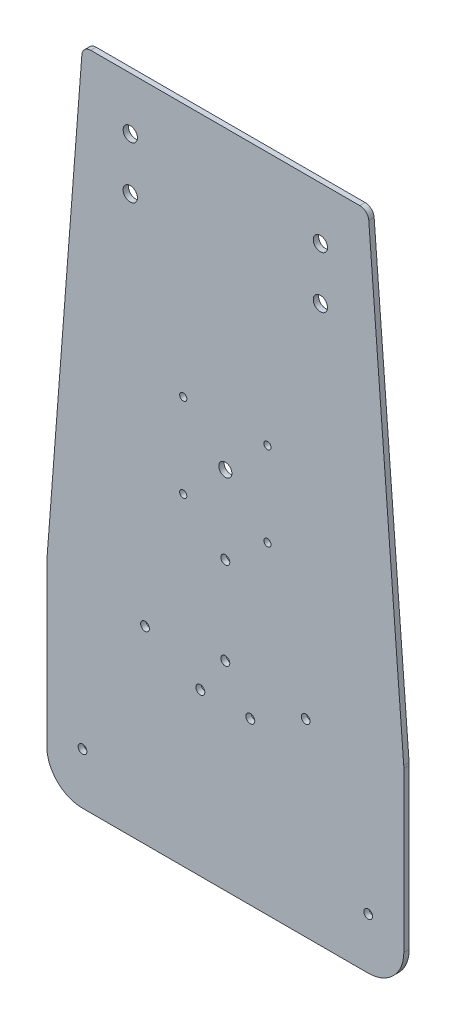
ISO-10303-21;
HEADER;
FILE_DESCRIPTION(('STEP AP214'),'2;1');
FILE_NAME('part.step','',(''),(''),'','','');
FILE_SCHEMA(('AUTOMOTIVE_DESIGN { 1 0 10303 214 1 1 1 1 }'));
ENDSEC;
DATA;
#1=APPLICATION_CONTEXT('core data for automotive mechanical design processes');
#2=APPLICATION_PROTOCOL_DEFINITION('international standard','automotive_design',2000,#1);
#3=PRODUCT_CONTEXT('',#1,'mechanical');
#4=PRODUCT('Part','Part','',(#3));
#5=PRODUCT_RELATED_PRODUCT_CATEGORY('part','',(#4));
#6=PRODUCT_DEFINITION_FORMATION('','',#4);
#7=PRODUCT_DEFINITION_CONTEXT('part definition',#1,'design');
#8=PRODUCT_DEFINITION('design','',#6,#7);
#9=PRODUCT_DEFINITION_SHAPE('','',#8);
#10=(LENGTH_UNIT() NAMED_UNIT(*) SI_UNIT(.MILLI.,.METRE.));
#11=(NAMED_UNIT(*) PLANE_ANGLE_UNIT() SI_UNIT($,.RADIAN.));
#12=(NAMED_UNIT(*) SI_UNIT($,.STERADIAN.) SOLID_ANGLE_UNIT());
#13=UNCERTAINTY_MEASURE_WITH_UNIT(LENGTH_MEASURE(1.E-05),#10,'distance_accuracy_value','');
#14=(GEOMETRIC_REPRESENTATION_CONTEXT(3) GLOBAL_UNCERTAINTY_ASSIGNED_CONTEXT((#13)) GLOBAL_UNIT_ASSIGNED_CONTEXT((#10,
#11,#12)) REPRESENTATION_CONTEXT('',''));
#15=CARTESIAN_POINT('',(0.,0.,0.));
#16=DIRECTION('',(0.,0.,1.));
#17=DIRECTION('',(1.,0.,0.));
#18=AXIS2_PLACEMENT_3D('',#15,#16,#17);
#19=CARTESIAN_POINT('',(0.,0.,3.));
#20=DIRECTION('',(0.,0.,-1.));
#21=DIRECTION('',(-1.,0.,0.));
#22=AXIS2_PLACEMENT_3D('',#19,#20,#21);
#23=PLANE('',#22);
#24=DIRECTION('',(-0.0766964988847372,0.997054485501581,0.));
#25=VECTOR('',#24,1.);
#26=CARTESIAN_POINT('',(100.,-94.2,3.));
#27=LINE('',#26,#25);
#28=CARTESIAN_POINT('',(99.9410897100316,-93.4341662304113,3.));
#29=VERTEX_POINT('',#28);
#30=CARTESIAN_POINT('',(80.3551167311982,161.183482494424,3.));
#31=VERTEX_POINT('',#30);
#32=EDGE_CURVE('E178',#29,#31,#27,.T.);
#33=ORIENTED_EDGE('',*,*,#32,.T.);
#34=CARTESIAN_POINT('',(75.3698443036902,160.8,3.));
#35=DIRECTION('',(0.,0.,-1.));
#36=DIRECTION('',(-1.,0.,0.));
#37=AXIS2_PLACEMENT_3D('',#34,#35,#36);
#38=CIRCLE('',#37,5.);
#39=CARTESIAN_POINT('',(75.3698443036902,165.8,3.));
#40=VERTEX_POINT('',#39);
#41=EDGE_CURVE('E48',#31,#40,#38,.F.);
#42=ORIENTED_EDGE('',*,*,#41,.T.);
#43=DIRECTION('',(-1.,0.,0.));
#44=VECTOR('',#43,1.);
#45=CARTESIAN_POINT('',(80.,165.8,3.));
#46=LINE('',#45,#44);
#47=CARTESIAN_POINT('',(-75.3698443036903,165.8,3.));
#48=VERTEX_POINT('',#47);
#49=EDGE_CURVE('E176',#40,#48,#46,.T.);
#50=ORIENTED_EDGE('',*,*,#49,.T.);
#51=CARTESIAN_POINT('',(-75.3698443036903,160.8,3.));
#52=DIRECTION('',(0.,0.,-1.));
#53=DIRECTION('',(-1.,0.,0.));
#54=AXIS2_PLACEMENT_3D('',#51,#52,#53);
#55=CIRCLE('',#54,5.);
#56=CARTESIAN_POINT('',(-80.3551167311982,161.183482494423,3.));
#57=VERTEX_POINT('',#56);
#58=EDGE_CURVE('E55',#48,#57,#55,.F.);
#59=ORIENTED_EDGE('',*,*,#58,.T.);
#60=DIRECTION('',(-0.076696498884737,-0.997054485501581,0.));
#61=VECTOR('',#60,1.);
#62=CARTESIAN_POINT('',(-100.,-94.2,3.));
#63=LINE('',#62,#61);
#64=CARTESIAN_POINT('',(-99.9410897100317,-93.4341662304113,3.));
#65=VERTEX_POINT('',#64);
#66=EDGE_CURVE('E249',#57,#65,#63,.T.);
#67=ORIENTED_EDGE('',*,*,#66,.T.);
#68=CARTESIAN_POINT('',(-80.,-94.968096208106,3.));
#69=DIRECTION('',(0.,0.,-1.));
#70=DIRECTION('',(-1.,0.,0.));
#71=AXIS2_PLACEMENT_3D('',#68,#69,#70);
#72=CIRCLE('',#71,20.);
#73=CARTESIAN_POINT('',(-100.,-94.968096208106,3.));
#74=VERTEX_POINT('',#73);
#75=EDGE_CURVE('E208',#65,#74,#72,.F.);
#76=ORIENTED_EDGE('',*,*,#75,.T.);
#77=DIRECTION('',(0.,-1.,0.));
#78=VECTOR('',#77,1.);
#79=CARTESIAN_POINT('',(-100.,-204.2,3.));
#80=LINE('',#79,#78);
#81=CARTESIAN_POINT('',(-100.,-184.2,3.));
#82=VERTEX_POINT('',#81);
#83=EDGE_CURVE('E270',#74,#82,#80,.T.);
#84=ORIENTED_EDGE('',*,*,#83,.T.);
#85=CARTESIAN_POINT('',(-80.,-184.2,3.));
#86=DIRECTION('',(0.,0.,-1.));
#87=DIRECTION('',(-1.,0.,0.));
#88=AXIS2_PLACEMENT_3D('',#85,#86,#87);
#89=CIRCLE('',#88,20.);
#90=CARTESIAN_POINT('',(-80.,-204.2,3.));
#91=VERTEX_POINT('',#90);
#92=EDGE_CURVE('E187',#82,#91,#89,.F.);
#93=ORIENTED_EDGE('',*,*,#92,.T.);
#94=DIRECTION('',(1.,0.,0.));
#95=VECTOR('',#94,1.);
#96=CARTESIAN_POINT('',(-100.,-204.2,3.));
#97=LINE('',#96,#95);
#98=CARTESIAN_POINT('',(80.,-204.2,3.));
#99=VERTEX_POINT('',#98);
#100=EDGE_CURVE('E153',#91,#99,#97,.T.);
#101=ORIENTED_EDGE('',*,*,#100,.T.);
#102=CARTESIAN_POINT('',(80.,-184.2,3.));
#103=DIRECTION('',(0.,0.,-1.));
#104=DIRECTION('',(-1.,0.,0.));
#105=AXIS2_PLACEMENT_3D('',#102,#103,#104);
#106=CIRCLE('',#105,20.);
#107=CARTESIAN_POINT('',(100.,-184.2,3.));
#108=VERTEX_POINT('',#107);
#109=EDGE_CURVE('E184',#99,#108,#106,.F.);
#110=ORIENTED_EDGE('',*,*,#109,.T.);
#111=DIRECTION('',(0.,1.,0.));
#112=VECTOR('',#111,1.);
#113=CARTESIAN_POINT('',(100.,-204.2,3.));
#114=LINE('',#113,#112);
#115=CARTESIAN_POINT('',(100.,-94.968096208106,3.));
#116=VERTEX_POINT('',#115);
#117=EDGE_CURVE('E265',#108,#116,#114,.T.);
#118=ORIENTED_EDGE('',*,*,#117,.T.);
#119=CARTESIAN_POINT('',(80.,-94.968096208106,3.));
#120=DIRECTION('',(0.,0.,-1.));
#121=DIRECTION('',(-1.,0.,0.));
#122=AXIS2_PLACEMENT_3D('',#119,#120,#121);
#123=CIRCLE('',#122,20.);
#124=EDGE_CURVE('E211',#116,#29,#123,.F.);
#125=ORIENTED_EDGE('',*,*,#124,.T.);
#126=EDGE_LOOP('',(#33,#42,#50,#59,#67,#76,#84,#93,#101,#110,#118,#125));
#127=FACE_BOUND('',#126,.T.);
#128=CARTESIAN_POINT('',(-23.57,23.57,3.));
#129=DIRECTION('',(0.,0.,1.));
#130=DIRECTION('',(1.,0.,0.));
#131=AXIS2_PLACEMENT_3D('',#128,#129,#130);
#132=CIRCLE('',#131,2.);
#133=CARTESIAN_POINT('',(-21.57,23.57,3.));
#134=VERTEX_POINT('',#133);
#135=EDGE_CURVE('E281',#134,#134,#132,.T.);
#136=ORIENTED_EDGE('',*,*,#135,.F.);
#137=EDGE_LOOP('',(#136));
#138=FACE_BOUND('',#137,.T.);
#139=CARTESIAN_POINT('',(23.57,23.57,3.));
#140=DIRECTION('',(0.,0.,1.));
#141=DIRECTION('',(1.,0.,0.));
#142=AXIS2_PLACEMENT_3D('',#139,#140,#141);
#143=CIRCLE('',#142,2.);
#144=CARTESIAN_POINT('',(25.57,23.57,3.));
#145=VERTEX_POINT('',#144);
#146=EDGE_CURVE('E703',#145,#145,#143,.T.);
#147=ORIENTED_EDGE('',*,*,#146,.F.);
#148=EDGE_LOOP('',(#147));
#149=FACE_BOUND('',#148,.T.);
#150=CARTESIAN_POINT('',(-23.57,-23.57,3.));
#151=DIRECTION('',(0.,0.,1.));
#152=DIRECTION('',(1.,0.,0.));
#153=AXIS2_PLACEMENT_3D('',#150,#151,#152);
#154=CIRCLE('',#153,2.);
#155=CARTESIAN_POINT('',(-21.57,-23.57,3.));
#156=VERTEX_POINT('',#155);
#157=EDGE_CURVE('E695',#156,#156,#154,.T.);
#158=ORIENTED_EDGE('',*,*,#157,.F.);
#159=EDGE_LOOP('',(#158));
#160=FACE_BOUND('',#159,.T.);
#161=CARTESIAN_POINT('',(23.57,-23.57,3.));
#162=DIRECTION('',(0.,0.,1.));
#163=DIRECTION('',(1.,0.,0.));
#164=AXIS2_PLACEMENT_3D('',#161,#162,#163);
#165=CIRCLE('',#164,2.);
#166=CARTESIAN_POINT('',(25.57,-23.57,3.));
#167=VERTEX_POINT('',#166);
#168=EDGE_CURVE('E687',#167,#167,#165,.T.);
#169=ORIENTED_EDGE('',*,*,#168,.F.);
#170=EDGE_LOOP('',(#169));
#171=FACE_BOUND('',#170,.T.);
#172=CARTESIAN_POINT('',(0.,0.,3.));
#173=DIRECTION('',(0.,0.,1.));
#174=DIRECTION('',(1.,0.,0.));
#175=AXIS2_PLACEMENT_3D('',#172,#173,#174);
#176=CIRCLE('',#175,3.675);
#177=CARTESIAN_POINT('',(3.67499999999999,0.,3.));
#178=VERTEX_POINT('',#177);
#179=EDGE_CURVE('E679',#178,#178,#176,.T.);
#180=ORIENTED_EDGE('',*,*,#179,.F.);
#181=EDGE_LOOP('',(#180));
#182=FACE_BOUND('',#181,.T.);
#183=CARTESIAN_POINT('',(-14.,-113.7,3.));
#184=DIRECTION('',(0.,0.,1.));
#185=DIRECTION('',(1.,0.,0.));
#186=AXIS2_PLACEMENT_3D('',#183,#184,#185);
#187=CIRCLE('',#186,2.5);
#188=CARTESIAN_POINT('',(-11.5,-113.7,3.));
#189=VERTEX_POINT('',#188);
#190=EDGE_CURVE('E671',#189,#189,#187,.T.);
#191=ORIENTED_EDGE('',*,*,#190,.F.);
#192=EDGE_LOOP('',(#191));
#193=FACE_BOUND('',#192,.T.);
#194=CARTESIAN_POINT('',(14.,-113.7,3.));
#195=DIRECTION('',(0.,0.,1.));
#196=DIRECTION('',(-1.,0.,0.));
#197=AXIS2_PLACEMENT_3D('',#194,#195,#196);
#198=CIRCLE('',#197,2.5);
#199=CARTESIAN_POINT('',(11.5,-113.7,3.));
#200=VERTEX_POINT('',#199);
#201=EDGE_CURVE('E663',#200,#200,#198,.T.);
#202=ORIENTED_EDGE('',*,*,#201,.F.);
#203=EDGE_LOOP('',(#202));
#204=FACE_BOUND('',#203,.T.);
#205=CARTESIAN_POINT('',(-45.,-98.4,3.));
#206=DIRECTION('',(0.,0.,1.));
#207=DIRECTION('',(1.,0.,0.));
#208=AXIS2_PLACEMENT_3D('',#205,#206,#207);
#209=CIRCLE('',#208,2.44999999999999);
#210=CARTESIAN_POINT('',(-42.55,-98.4,3.));
#211=VERTEX_POINT('',#210);
#212=EDGE_CURVE('E655',#211,#211,#209,.T.);
#213=ORIENTED_EDGE('',*,*,#212,.F.);
#214=EDGE_LOOP('',(#213));
#215=FACE_BOUND('',#214,.T.);
#216=CARTESIAN_POINT('',(45.,-98.4,3.));
#217=DIRECTION('',(0.,0.,1.));
#218=DIRECTION('',(-1.,0.,0.));
#219=AXIS2_PLACEMENT_3D('',#216,#217,#218);
#220=CIRCLE('',#219,2.44999999999999);
#221=CARTESIAN_POINT('',(42.55,-98.4,3.));
#222=VERTEX_POINT('',#221);
#223=EDGE_CURVE('E647',#222,#222,#220,.T.);
#224=ORIENTED_EDGE('',*,*,#223,.F.);
#225=EDGE_LOOP('',(#224));
#226=FACE_BOUND('',#225,.T.);
#227=CARTESIAN_POINT('',(-80.,-175.5,3.));
#228=DIRECTION('',(0.,0.,1.));
#229=DIRECTION('',(1.,0.,0.));
#230=AXIS2_PLACEMENT_3D('',#227,#228,#229);
#231=CIRCLE('',#230,2.45);
#232=CARTESIAN_POINT('',(-77.55,-175.5,3.));
#233=VERTEX_POINT('',#232);
#234=EDGE_CURVE('E639',#233,#233,#231,.T.);
#235=ORIENTED_EDGE('',*,*,#234,.F.);
#236=EDGE_LOOP('',(#235));
#237=FACE_BOUND('',#236,.T.);
#238=CARTESIAN_POINT('',(80.,-175.5,3.));
#239=DIRECTION('',(0.,0.,1.));
#240=DIRECTION('',(-1.,0.,0.));
#241=AXIS2_PLACEMENT_3D('',#238,#239,#240);
#242=CIRCLE('',#241,2.45);
#243=CARTESIAN_POINT('',(77.55,-175.5,3.));
#244=VERTEX_POINT('',#243);
#245=EDGE_CURVE('E631',#244,#244,#242,.T.);
#246=ORIENTED_EDGE('',*,*,#245,.F.);
#247=EDGE_LOOP('',(#246));
#248=FACE_BOUND('',#247,.T.);
#249=CARTESIAN_POINT('',(0.,-43.7,3.));
#250=DIRECTION('',(0.,0.,1.));
#251=DIRECTION('',(1.,0.,0.));
#252=AXIS2_PLACEMENT_3D('',#249,#250,#251);
#253=CIRCLE('',#252,2.5);
#254=CARTESIAN_POINT('',(2.50000000000001,-43.7,3.));
#255=VERTEX_POINT('',#254);
#256=EDGE_CURVE('E623',#255,#255,#253,.T.);
#257=ORIENTED_EDGE('',*,*,#256,.F.);
#258=EDGE_LOOP('',(#257));
#259=FACE_BOUND('',#258,.T.);
#260=CARTESIAN_POINT('',(0.,-92.7,3.));
#261=DIRECTION('',(0.,0.,1.));
#262=DIRECTION('',(1.,0.,0.));
#263=AXIS2_PLACEMENT_3D('',#260,#261,#262);
#264=CIRCLE('',#263,2.5);
#265=CARTESIAN_POINT('',(2.50000000000001,-92.7,3.));
#266=VERTEX_POINT('',#265);
#267=EDGE_CURVE('E615',#266,#266,#264,.T.);
#268=ORIENTED_EDGE('',*,*,#267,.F.);
#269=EDGE_LOOP('',(#268));
#270=FACE_BOUND('',#269,.T.);
#271=CARTESIAN_POINT('',(53.25,136.35,3.));
#272=DIRECTION('',(0.,0.,1.));
#273=DIRECTION('',(1.,0.,0.));
#274=AXIS2_PLACEMENT_3D('',#271,#272,#273);
#275=CIRCLE('',#274,4.);
#276=CARTESIAN_POINT('',(57.25,136.35,3.));
#277=VERTEX_POINT('',#276);
#278=EDGE_CURVE('E607',#277,#277,#275,.T.);
#279=ORIENTED_EDGE('',*,*,#278,.F.);
#280=EDGE_LOOP('',(#279));
#281=FACE_BOUND('',#280,.T.);
#282=CARTESIAN_POINT('',(53.25,107.25,3.));
#283=DIRECTION('',(0.,0.,1.));
#284=DIRECTION('',(-1.,0.,0.));
#285=AXIS2_PLACEMENT_3D('',#282,#283,#284);
#286=CIRCLE('',#285,4.);
#287=CARTESIAN_POINT('',(49.25,107.25,3.));
#288=VERTEX_POINT('',#287);
#289=EDGE_CURVE('E599',#288,#288,#286,.T.);
#290=ORIENTED_EDGE('',*,*,#289,.F.);
#291=EDGE_LOOP('',(#290));
#292=FACE_BOUND('',#291,.T.);
#293=CARTESIAN_POINT('',(-53.2500000000001,107.25,3.));
#294=DIRECTION('',(0.,0.,1.));
#295=DIRECTION('',(1.,0.,0.));
#296=AXIS2_PLACEMENT_3D('',#293,#294,#295);
#297=CIRCLE('',#296,4.);
#298=CARTESIAN_POINT('',(-49.2500000000001,107.25,3.));
#299=VERTEX_POINT('',#298);
#300=EDGE_CURVE('E591',#299,#299,#297,.T.);
#301=ORIENTED_EDGE('',*,*,#300,.F.);
#302=EDGE_LOOP('',(#301));
#303=FACE_BOUND('',#302,.T.);
#304=CARTESIAN_POINT('',(-53.2500000000001,136.35,3.));
#305=DIRECTION('',(0.,0.,1.));
#306=DIRECTION('',(-1.,0.,0.));
#307=AXIS2_PLACEMENT_3D('',#304,#305,#306);
#308=CIRCLE('',#307,4.);
#309=CARTESIAN_POINT('',(-57.2500000000001,136.35,3.));
#310=VERTEX_POINT('',#309);
#311=EDGE_CURVE('E580',#310,#310,#308,.T.);
#312=ORIENTED_EDGE('',*,*,#311,.F.);
#313=EDGE_LOOP('',(#312));
#314=FACE_BOUND('',#313,.T.);
#315=ADVANCED_FACE('F39',(#127,#138,#149,#160,#171,#182,#193,#204,#215,#226,#237,#248,#259,#270,
#281,#292,#303,#314),#23,.F.);
#316=CARTESIAN_POINT('',(0.,0.,0.));
#317=DIRECTION('',(0.,0.,-1.));
#318=DIRECTION('',(-1.,0.,0.));
#319=AXIS2_PLACEMENT_3D('',#316,#317,#318);
#320=PLANE('',#319);
#321=CARTESIAN_POINT('',(-53.2500000000001,107.25,0.));
#322=DIRECTION('',(0.,0.,1.));
#323=DIRECTION('',(1.,0.,0.));
#324=AXIS2_PLACEMENT_3D('',#321,#322,#323);
#325=CIRCLE('',#324,4.);
#326=CARTESIAN_POINT('',(-49.2500000000001,107.25,0.));
#327=VERTEX_POINT('',#326);
#328=EDGE_CURVE('E588',#327,#327,#325,.T.);
#329=ORIENTED_EDGE('',*,*,#328,.T.);
#330=EDGE_LOOP('',(#329));
#331=FACE_BOUND('',#330,.T.);
#332=CARTESIAN_POINT('',(53.25,136.35,0.));
#333=DIRECTION('',(0.,0.,1.));
#334=DIRECTION('',(1.,0.,0.));
#335=AXIS2_PLACEMENT_3D('',#332,#333,#334);
#336=CIRCLE('',#335,4.);
#337=CARTESIAN_POINT('',(57.25,136.35,0.));
#338=VERTEX_POINT('',#337);
#339=EDGE_CURVE('E603',#338,#338,#336,.T.);
#340=ORIENTED_EDGE('',*,*,#339,.T.);
#341=EDGE_LOOP('',(#340));
#342=FACE_BOUND('',#341,.T.);
#343=CARTESIAN_POINT('',(0.,-43.7,0.));
#344=DIRECTION('',(0.,0.,1.));
#345=DIRECTION('',(1.,0.,0.));
#346=AXIS2_PLACEMENT_3D('',#343,#344,#345);
#347=CIRCLE('',#346,2.5);
#348=CARTESIAN_POINT('',(2.50000000000001,-43.7,0.));
#349=VERTEX_POINT('',#348);
#350=EDGE_CURVE('E619',#349,#349,#347,.T.);
#351=ORIENTED_EDGE('',*,*,#350,.T.);
#352=EDGE_LOOP('',(#351));
#353=FACE_BOUND('',#352,.T.);
#354=CARTESIAN_POINT('',(-80.,-175.5,0.));
#355=DIRECTION('',(0.,0.,1.));
#356=DIRECTION('',(1.,0.,0.));
#357=AXIS2_PLACEMENT_3D('',#354,#355,#356);
#358=CIRCLE('',#357,2.45);
#359=CARTESIAN_POINT('',(-77.55,-175.5,0.));
#360=VERTEX_POINT('',#359);
#361=EDGE_CURVE('E635',#360,#360,#358,.T.);
#362=ORIENTED_EDGE('',*,*,#361,.T.);
#363=EDGE_LOOP('',(#362));
#364=FACE_BOUND('',#363,.T.);
#365=CARTESIAN_POINT('',(-45.,-98.4,0.));
#366=DIRECTION('',(0.,0.,1.));
#367=DIRECTION('',(1.,0.,0.));
#368=AXIS2_PLACEMENT_3D('',#365,#366,#367);
#369=CIRCLE('',#368,2.44999999999999);
#370=CARTESIAN_POINT('',(-42.55,-98.4,0.));
#371=VERTEX_POINT('',#370);
#372=EDGE_CURVE('E651',#371,#371,#369,.T.);
#373=ORIENTED_EDGE('',*,*,#372,.T.);
#374=EDGE_LOOP('',(#373));
#375=FACE_BOUND('',#374,.T.);
#376=CARTESIAN_POINT('',(-14.,-113.7,0.));
#377=DIRECTION('',(0.,0.,1.));
#378=DIRECTION('',(1.,0.,0.));
#379=AXIS2_PLACEMENT_3D('',#376,#377,#378);
#380=CIRCLE('',#379,2.5);
#381=CARTESIAN_POINT('',(-11.5,-113.7,0.));
#382=VERTEX_POINT('',#381);
#383=EDGE_CURVE('E667',#382,#382,#380,.T.);
#384=ORIENTED_EDGE('',*,*,#383,.T.);
#385=EDGE_LOOP('',(#384));
#386=FACE_BOUND('',#385,.T.);
#387=CARTESIAN_POINT('',(23.57,-23.57,0.));
#388=DIRECTION('',(0.,0.,1.));
#389=DIRECTION('',(1.,0.,0.));
#390=AXIS2_PLACEMENT_3D('',#387,#388,#389);
#391=CIRCLE('',#390,2.);
#392=CARTESIAN_POINT('',(25.57,-23.57,0.));
#393=VERTEX_POINT('',#392);
#394=EDGE_CURVE('E683',#393,#393,#391,.T.);
#395=ORIENTED_EDGE('',*,*,#394,.T.);
#396=EDGE_LOOP('',(#395));
#397=FACE_BOUND('',#396,.T.);
#398=CARTESIAN_POINT('',(23.57,23.57,0.));
#399=DIRECTION('',(0.,0.,1.));
#400=DIRECTION('',(1.,0.,0.));
#401=AXIS2_PLACEMENT_3D('',#398,#399,#400);
#402=CIRCLE('',#401,2.);
#403=CARTESIAN_POINT('',(25.57,23.57,0.));
#404=VERTEX_POINT('',#403);
#405=EDGE_CURVE('E699',#404,#404,#402,.T.);
#406=ORIENTED_EDGE('',*,*,#405,.T.);
#407=EDGE_LOOP('',(#406));
#408=FACE_BOUND('',#407,.T.);
#409=DIRECTION('',(-1.,0.,0.));
#410=VECTOR('',#409,1.);
#411=CARTESIAN_POINT('',(80.,165.8,0.));
#412=LINE('',#411,#410);
#413=CARTESIAN_POINT('',(75.3698443036902,165.8,0.));
#414=VERTEX_POINT('',#413);
#415=CARTESIAN_POINT('',(-75.3698443036903,165.8,0.));
#416=VERTEX_POINT('',#415);
#417=EDGE_CURVE('E253',#414,#416,#412,.T.);
#418=ORIENTED_EDGE('',*,*,#417,.F.);
#419=CARTESIAN_POINT('',(75.3698443036902,160.8,0.));
#420=DIRECTION('',(0.,0.,-1.));
#421=DIRECTION('',(-1.,0.,0.));
#422=AXIS2_PLACEMENT_3D('',#419,#420,#421);
#423=CIRCLE('',#422,5.);
#424=CARTESIAN_POINT('',(80.3551167311982,161.183482494424,0.));
#425=VERTEX_POINT('',#424);
#426=EDGE_CURVE('E232',#414,#425,#423,.T.);
#427=ORIENTED_EDGE('',*,*,#426,.T.);
#428=DIRECTION('',(-0.0766964988847372,0.997054485501581,0.));
#429=VECTOR('',#428,1.);
#430=CARTESIAN_POINT('',(100.,-94.2,0.));
#431=LINE('',#430,#429);
#432=CARTESIAN_POINT('',(99.9410897100316,-93.4341662304113,0.));
#433=VERTEX_POINT('',#432);
#434=EDGE_CURVE('E168',#433,#425,#431,.T.);
#435=ORIENTED_EDGE('',*,*,#434,.F.);
#436=CARTESIAN_POINT('',(80.,-94.968096208106,0.));
#437=DIRECTION('',(0.,0.,-1.));
#438=DIRECTION('',(-1.,0.,0.));
#439=AXIS2_PLACEMENT_3D('',#436,#437,#438);
#440=CIRCLE('',#439,20.);
#441=CARTESIAN_POINT('',(100.,-94.968096208106,0.));
#442=VERTEX_POINT('',#441);
#443=EDGE_CURVE('E202',#433,#442,#440,.T.);
#444=ORIENTED_EDGE('',*,*,#443,.T.);
#445=DIRECTION('',(0.,1.,0.));
#446=VECTOR('',#445,1.);
#447=CARTESIAN_POINT('',(100.,-204.2,0.));
#448=LINE('',#447,#446);
#449=CARTESIAN_POINT('',(100.,-184.2,0.));
#450=VERTEX_POINT('',#449);
#451=EDGE_CURVE('E162',#450,#442,#448,.T.);
#452=ORIENTED_EDGE('',*,*,#451,.F.);
#453=CARTESIAN_POINT('',(80.,-184.2,0.));
#454=DIRECTION('',(0.,0.,-1.));
#455=DIRECTION('',(-1.,0.,0.));
#456=AXIS2_PLACEMENT_3D('',#453,#454,#455);
#457=CIRCLE('',#456,20.);
#458=CARTESIAN_POINT('',(80.,-204.2,0.));
#459=VERTEX_POINT('',#458);
#460=EDGE_CURVE('E144',#450,#459,#457,.T.);
#461=ORIENTED_EDGE('',*,*,#460,.T.);
#462=DIRECTION('',(1.,0.,0.));
#463=VECTOR('',#462,1.);
#464=CARTESIAN_POINT('',(-100.,-204.2,0.));
#465=LINE('',#464,#463);
#466=CARTESIAN_POINT('',(-80.,-204.2,0.));
#467=VERTEX_POINT('',#466);
#468=EDGE_CURVE('E150',#467,#459,#465,.T.);
#469=ORIENTED_EDGE('',*,*,#468,.F.);
#470=CARTESIAN_POINT('',(-80.,-184.2,0.));
#471=DIRECTION('',(0.,0.,-1.));
#472=DIRECTION('',(-1.,0.,0.));
#473=AXIS2_PLACEMENT_3D('',#470,#471,#472);
#474=CIRCLE('',#473,20.);
#475=CARTESIAN_POINT('',(-100.,-184.2,0.));
#476=VERTEX_POINT('',#475);
#477=EDGE_CURVE('E133',#467,#476,#474,.T.);
#478=ORIENTED_EDGE('',*,*,#477,.T.);
#479=DIRECTION('',(0.,-1.,0.));
#480=VECTOR('',#479,1.);
#481=CARTESIAN_POINT('',(-100.,-204.2,0.));
#482=LINE('',#481,#480);
#483=CARTESIAN_POINT('',(-100.,-94.968096208106,0.));
#484=VERTEX_POINT('',#483);
#485=EDGE_CURVE('E163',#484,#476,#482,.T.);
#486=ORIENTED_EDGE('',*,*,#485,.F.);
#487=CARTESIAN_POINT('',(-80.,-94.968096208106,0.));
#488=DIRECTION('',(0.,0.,-1.));
#489=DIRECTION('',(-1.,0.,0.));
#490=AXIS2_PLACEMENT_3D('',#487,#488,#489);
#491=CIRCLE('',#490,20.);
#492=CARTESIAN_POINT('',(-99.9410897100317,-93.4341662304113,0.));
#493=VERTEX_POINT('',#492);
#494=EDGE_CURVE('E198',#484,#493,#491,.T.);
#495=ORIENTED_EDGE('',*,*,#494,.T.);
#496=DIRECTION('',(-0.076696498884737,-0.997054485501581,0.));
#497=VECTOR('',#496,1.);
#498=CARTESIAN_POINT('',(-100.,-94.2,0.));
#499=LINE('',#498,#497);
#500=CARTESIAN_POINT('',(-80.3551167311982,161.183482494423,0.));
#501=VERTEX_POINT('',#500);
#502=EDGE_CURVE('E170',#501,#493,#499,.T.);
#503=ORIENTED_EDGE('',*,*,#502,.F.);
#504=CARTESIAN_POINT('',(-75.3698443036903,160.8,0.));
#505=DIRECTION('',(0.,0.,-1.));
#506=DIRECTION('',(-1.,0.,0.));
#507=AXIS2_PLACEMENT_3D('',#504,#505,#506);
#508=CIRCLE('',#507,5.);
#509=EDGE_CURVE('E229',#501,#416,#508,.T.);
#510=ORIENTED_EDGE('',*,*,#509,.T.);
#511=EDGE_LOOP('',(#418,#427,#435,#444,#452,#461,#469,#478,#486,#495,#503,#510));
#512=FACE_BOUND('',#511,.T.);
#513=CARTESIAN_POINT('',(-23.57,23.57,0.));
#514=DIRECTION('',(0.,0.,1.));
#515=DIRECTION('',(1.,0.,0.));
#516=AXIS2_PLACEMENT_3D('',#513,#514,#515);
#517=CIRCLE('',#516,2.);
#518=CARTESIAN_POINT('',(-21.57,23.57,0.));
#519=VERTEX_POINT('',#518);
#520=EDGE_CURVE('E707',#519,#519,#517,.T.);
#521=ORIENTED_EDGE('',*,*,#520,.T.);
#522=EDGE_LOOP('',(#521));
#523=FACE_BOUND('',#522,.T.);
#524=CARTESIAN_POINT('',(-23.57,-23.57,0.));
#525=DIRECTION('',(0.,0.,1.));
#526=DIRECTION('',(1.,0.,0.));
#527=AXIS2_PLACEMENT_3D('',#524,#525,#526);
#528=CIRCLE('',#527,2.);
#529=CARTESIAN_POINT('',(-21.57,-23.57,0.));
#530=VERTEX_POINT('',#529);
#531=EDGE_CURVE('E691',#530,#530,#528,.T.);
#532=ORIENTED_EDGE('',*,*,#531,.T.);
#533=EDGE_LOOP('',(#532));
#534=FACE_BOUND('',#533,.T.);
#535=CARTESIAN_POINT('',(0.,0.,0.));
#536=DIRECTION('',(0.,0.,1.));
#537=DIRECTION('',(1.,0.,0.));
#538=AXIS2_PLACEMENT_3D('',#535,#536,#537);
#539=CIRCLE('',#538,3.675);
#540=CARTESIAN_POINT('',(3.67499999999999,0.,0.));
#541=VERTEX_POINT('',#540);
#542=EDGE_CURVE('E675',#541,#541,#539,.T.);
#543=ORIENTED_EDGE('',*,*,#542,.T.);
#544=EDGE_LOOP('',(#543));
#545=FACE_BOUND('',#544,.T.);
#546=CARTESIAN_POINT('',(14.,-113.7,0.));
#547=DIRECTION('',(0.,0.,1.));
#548=DIRECTION('',(-1.,0.,0.));
#549=AXIS2_PLACEMENT_3D('',#546,#547,#548);
#550=CIRCLE('',#549,2.5);
#551=CARTESIAN_POINT('',(11.5,-113.7,0.));
#552=VERTEX_POINT('',#551);
#553=EDGE_CURVE('E659',#552,#552,#550,.T.);
#554=ORIENTED_EDGE('',*,*,#553,.T.);
#555=EDGE_LOOP('',(#554));
#556=FACE_BOUND('',#555,.T.);
#557=CARTESIAN_POINT('',(45.,-98.4,0.));
#558=DIRECTION('',(0.,0.,1.));
#559=DIRECTION('',(-1.,0.,0.));
#560=AXIS2_PLACEMENT_3D('',#557,#558,#559);
#561=CIRCLE('',#560,2.44999999999999);
#562=CARTESIAN_POINT('',(42.55,-98.4,0.));
#563=VERTEX_POINT('',#562);
#564=EDGE_CURVE('E643',#563,#563,#561,.T.);
#565=ORIENTED_EDGE('',*,*,#564,.T.);
#566=EDGE_LOOP('',(#565));
#567=FACE_BOUND('',#566,.T.);
#568=CARTESIAN_POINT('',(80.,-175.5,0.));
#569=DIRECTION('',(0.,0.,1.));
#570=DIRECTION('',(-1.,0.,0.));
#571=AXIS2_PLACEMENT_3D('',#568,#569,#570);
#572=CIRCLE('',#571,2.45);
#573=CARTESIAN_POINT('',(77.55,-175.5,0.));
#574=VERTEX_POINT('',#573);
#575=EDGE_CURVE('E627',#574,#574,#572,.T.);
#576=ORIENTED_EDGE('',*,*,#575,.T.);
#577=EDGE_LOOP('',(#576));
#578=FACE_BOUND('',#577,.T.);
#579=CARTESIAN_POINT('',(0.,-92.7,0.));
#580=DIRECTION('',(0.,0.,1.));
#581=DIRECTION('',(1.,0.,0.));
#582=AXIS2_PLACEMENT_3D('',#579,#580,#581);
#583=CIRCLE('',#582,2.5);
#584=CARTESIAN_POINT('',(2.50000000000001,-92.7,0.));
#585=VERTEX_POINT('',#584);
#586=EDGE_CURVE('E611',#585,#585,#583,.T.);
#587=ORIENTED_EDGE('',*,*,#586,.T.);
#588=EDGE_LOOP('',(#587));
#589=FACE_BOUND('',#588,.T.);
#590=CARTESIAN_POINT('',(53.25,107.25,0.));
#591=DIRECTION('',(0.,0.,1.));
#592=DIRECTION('',(-1.,0.,0.));
#593=AXIS2_PLACEMENT_3D('',#590,#591,#592);
#594=CIRCLE('',#593,4.);
#595=CARTESIAN_POINT('',(49.25,107.25,0.));
#596=VERTEX_POINT('',#595);
#597=EDGE_CURVE('E595',#596,#596,#594,.T.);
#598=ORIENTED_EDGE('',*,*,#597,.T.);
#599=EDGE_LOOP('',(#598));
#600=FACE_BOUND('',#599,.T.);
#601=CARTESIAN_POINT('',(-53.2500000000001,136.35,0.));
#602=DIRECTION('',(0.,0.,1.));
#603=DIRECTION('',(-1.,0.,0.));
#604=AXIS2_PLACEMENT_3D('',#601,#602,#603);
#605=CIRCLE('',#604,4.);
#606=CARTESIAN_POINT('',(-57.2500000000001,136.35,0.));
#607=VERTEX_POINT('',#606);
#608=EDGE_CURVE('E583',#607,#607,#605,.T.);
#609=ORIENTED_EDGE('',*,*,#608,.T.);
#610=EDGE_LOOP('',(#609));
#611=FACE_BOUND('',#610,.T.);
#612=ADVANCED_FACE('F158',(#331,#342,#353,#364,#375,#386,#397,#408,#512,#523,#534,#545,#556,
#567,#578,#589,#600,#611),#320,.T.);
#613=CARTESIAN_POINT('',(80.,165.8,3.));
#614=DIRECTION('',(0.,-1.,0.));
#615=DIRECTION('',(1.,0.,0.));
#616=AXIS2_PLACEMENT_3D('',#613,#614,#615);
#617=PLANE('',#616);
#618=ORIENTED_EDGE('',*,*,#49,.F.);
#619=DIRECTION('',(0.,0.,-1.));
#620=VECTOR('',#619,1.);
#621=CARTESIAN_POINT('',(75.3698443036902,165.8,3.));
#622=LINE('',#621,#620);
#623=EDGE_CURVE('E225',#40,#414,#622,.T.);
#624=ORIENTED_EDGE('',*,*,#623,.T.);
#625=ORIENTED_EDGE('',*,*,#417,.T.);
#626=DIRECTION('',(0.,0.,-1.));
#627=VECTOR('',#626,1.);
#628=CARTESIAN_POINT('',(-75.3698443036903,165.8,3.));
#629=LINE('',#628,#627);
#630=EDGE_CURVE('E222',#416,#48,#629,.F.);
#631=ORIENTED_EDGE('',*,*,#630,.T.);
#632=EDGE_LOOP('',(#618,#624,#625,#631));
#633=FACE_BOUND('',#632,.T.);
#634=ADVANCED_FACE('F245',(#633),#617,.F.);
#635=CARTESIAN_POINT('',(-100.,-94.2,3.));
#636=DIRECTION('',(0.997054485501582,-0.076696498884737,0.));
#637=DIRECTION('',(0.076696498884737,0.997054485501582,0.));
#638=AXIS2_PLACEMENT_3D('',#635,#636,#637);
#639=PLANE('',#638);
#640=ORIENTED_EDGE('',*,*,#66,.F.);
#641=DIRECTION('',(0.,0.,-1.));
#642=VECTOR('',#641,1.);
#643=CARTESIAN_POINT('',(-80.3551167311982,161.183482494424,3.));
#644=LINE('',#643,#642);
#645=EDGE_CURVE('E11',#57,#501,#644,.T.);
#646=ORIENTED_EDGE('',*,*,#645,.T.);
#647=ORIENTED_EDGE('',*,*,#502,.T.);
#648=DIRECTION('',(0.,0.,-1.));
#649=VECTOR('',#648,1.);
#650=CARTESIAN_POINT('',(-99.9410897100317,-93.4341662304113,3.));
#651=LINE('',#650,#649);
#652=EDGE_CURVE('E218',#493,#65,#651,.F.);
#653=ORIENTED_EDGE('',*,*,#652,.T.);
#654=EDGE_LOOP('',(#640,#646,#647,#653));
#655=FACE_BOUND('',#654,.T.);
#656=ADVANCED_FACE('F285',(#655),#639,.F.);
#657=CARTESIAN_POINT('',(-100.,-204.2,3.));
#658=DIRECTION('',(1.,0.,0.));
#659=DIRECTION('',(0.,1.,0.));
#660=AXIS2_PLACEMENT_3D('',#657,#658,#659);
#661=PLANE('',#660);
#662=ORIENTED_EDGE('',*,*,#83,.F.);
#663=DIRECTION('',(0.,0.,-1.));
#664=VECTOR('',#663,1.);
#665=CARTESIAN_POINT('',(-100.,-94.968096208106,3.));
#666=LINE('',#665,#664);
#667=EDGE_CURVE('E214',#74,#484,#666,.T.);
#668=ORIENTED_EDGE('',*,*,#667,.T.);
#669=ORIENTED_EDGE('',*,*,#485,.T.);
#670=DIRECTION('',(0.,0.,-1.));
#671=VECTOR('',#670,1.);
#672=CARTESIAN_POINT('',(-100.,-184.2,3.));
#673=LINE('',#672,#671);
#674=EDGE_CURVE('E139',#476,#82,#673,.F.);
#675=ORIENTED_EDGE('',*,*,#674,.T.);
#676=EDGE_LOOP('',(#662,#668,#669,#675));
#677=FACE_BOUND('',#676,.T.);
#678=ADVANCED_FACE('F294',(#677),#661,.F.);
#679=CARTESIAN_POINT('',(-100.,-204.2,3.));
#680=DIRECTION('',(0.,1.,0.));
#681=DIRECTION('',(-1.,0.,0.));
#682=AXIS2_PLACEMENT_3D('',#679,#680,#681);
#683=PLANE('',#682);
#684=ORIENTED_EDGE('',*,*,#100,.F.);
#685=DIRECTION('',(0.,0.,-1.));
#686=VECTOR('',#685,1.);
#687=CARTESIAN_POINT('',(-80.,-204.2,3.));
#688=LINE('',#687,#686);
#689=EDGE_CURVE('E137',#91,#467,#688,.T.);
#690=ORIENTED_EDGE('',*,*,#689,.T.);
#691=ORIENTED_EDGE('',*,*,#468,.T.);
#692=DIRECTION('',(0.,0.,-1.));
#693=VECTOR('',#692,1.);
#694=CARTESIAN_POINT('',(80.,-204.2,3.));
#695=LINE('',#694,#693);
#696=EDGE_CURVE('E155',#459,#99,#695,.F.);
#697=ORIENTED_EDGE('',*,*,#696,.T.);
#698=EDGE_LOOP('',(#684,#690,#691,#697));
#699=FACE_BOUND('',#698,.T.);
#700=ADVANCED_FACE('F149',(#699),#683,.F.);
#701=CARTESIAN_POINT('',(100.,-204.2,3.));
#702=DIRECTION('',(-1.,0.,0.));
#703=DIRECTION('',(0.,0.,1.));
#704=AXIS2_PLACEMENT_3D('',#701,#702,#703);
#705=PLANE('',#704);
#706=ORIENTED_EDGE('',*,*,#451,.T.);
#707=DIRECTION('',(0.,0.,-1.));
#708=VECTOR('',#707,1.);
#709=CARTESIAN_POINT('',(100.,-94.968096208106,3.));
#710=LINE('',#709,#708);
#711=EDGE_CURVE('E205',#442,#116,#710,.F.);
#712=ORIENTED_EDGE('',*,*,#711,.T.);
#713=ORIENTED_EDGE('',*,*,#117,.F.);
#714=DIRECTION('',(0.,0.,-1.));
#715=VECTOR('',#714,1.);
#716=CARTESIAN_POINT('',(100.,-184.2,3.));
#717=LINE('',#716,#715);
#718=EDGE_CURVE('E190',#108,#450,#717,.T.);
#719=ORIENTED_EDGE('',*,*,#718,.T.);
#720=EDGE_LOOP('',(#706,#712,#713,#719));
#721=FACE_BOUND('',#720,.T.);
#722=ADVANCED_FACE('F261',(#721),#705,.F.);
#723=CARTESIAN_POINT('',(100.,-94.2,3.));
#724=DIRECTION('',(-0.997054485501582,-0.0766964988847372,0.));
#725=DIRECTION('',(0.0766964988847372,-0.997054485501582,0.));
#726=AXIS2_PLACEMENT_3D('',#723,#724,#725);
#727=PLANE('',#726);
#728=ORIENTED_EDGE('',*,*,#434,.T.);
#729=DIRECTION('',(0.,0.,-1.));
#730=VECTOR('',#729,1.);
#731=CARTESIAN_POINT('',(80.3551167311981,161.183482494424,3.));
#732=LINE('',#731,#730);
#733=EDGE_CURVE('E63',#425,#31,#732,.F.);
#734=ORIENTED_EDGE('',*,*,#733,.T.);
#735=ORIENTED_EDGE('',*,*,#32,.F.);
#736=DIRECTION('',(0.,0.,-1.));
#737=VECTOR('',#736,1.);
#738=CARTESIAN_POINT('',(99.9410897100316,-93.4341662304113,3.));
#739=LINE('',#738,#737);
#740=EDGE_CURVE('E194',#29,#433,#739,.T.);
#741=ORIENTED_EDGE('',*,*,#740,.T.);
#742=EDGE_LOOP('',(#728,#734,#735,#741));
#743=FACE_BOUND('',#742,.T.);
#744=ADVANCED_FACE('F254',(#743),#727,.F.);
#745=CARTESIAN_POINT('',(-23.57,23.57,3.));
#746=DIRECTION('',(0.,0.,-1.));
#747=DIRECTION('',(-1.,0.,0.));
#748=AXIS2_PLACEMENT_3D('',#745,#746,#747);
#749=CYLINDRICAL_SURFACE('',#748,2.);
#750=ORIENTED_EDGE('',*,*,#135,.T.);
#751=EDGE_LOOP('',(#750));
#752=FACE_BOUND('',#751,.T.);
#753=ORIENTED_EDGE('',*,*,#520,.F.);
#754=EDGE_LOOP('',(#753));
#755=FACE_BOUND('',#754,.T.);
#756=ADVANCED_FACE('F311',(#752,#755),#749,.F.);
#757=CARTESIAN_POINT('',(23.57,23.57,3.));
#758=DIRECTION('',(0.,0.,-1.));
#759=DIRECTION('',(-1.,0.,0.));
#760=AXIS2_PLACEMENT_3D('',#757,#758,#759);
#761=CYLINDRICAL_SURFACE('',#760,2.);
#762=ORIENTED_EDGE('',*,*,#146,.T.);
#763=EDGE_LOOP('',(#762));
#764=FACE_BOUND('',#763,.T.);
#765=ORIENTED_EDGE('',*,*,#405,.F.);
#766=EDGE_LOOP('',(#765));
#767=FACE_BOUND('',#766,.T.);
#768=ADVANCED_FACE('F334',(#764,#767),#761,.F.);
#769=CARTESIAN_POINT('',(-23.57,-23.57,3.));
#770=DIRECTION('',(0.,0.,-1.));
#771=DIRECTION('',(-1.,0.,0.));
#772=AXIS2_PLACEMENT_3D('',#769,#770,#771);
#773=CYLINDRICAL_SURFACE('',#772,2.);
#774=ORIENTED_EDGE('',*,*,#157,.T.);
#775=EDGE_LOOP('',(#774));
#776=FACE_BOUND('',#775,.T.);
#777=ORIENTED_EDGE('',*,*,#531,.F.);
#778=EDGE_LOOP('',(#777));
#779=FACE_BOUND('',#778,.T.);
#780=ADVANCED_FACE('F341',(#776,#779),#773,.F.);
#781=CARTESIAN_POINT('',(23.57,-23.57,3.));
#782=DIRECTION('',(0.,0.,-1.));
#783=DIRECTION('',(-1.,0.,0.));
#784=AXIS2_PLACEMENT_3D('',#781,#782,#783);
#785=CYLINDRICAL_SURFACE('',#784,2.);
#786=ORIENTED_EDGE('',*,*,#168,.T.);
#787=EDGE_LOOP('',(#786));
#788=FACE_BOUND('',#787,.T.);
#789=ORIENTED_EDGE('',*,*,#394,.F.);
#790=EDGE_LOOP('',(#789));
#791=FACE_BOUND('',#790,.T.);
#792=ADVANCED_FACE('F348',(#788,#791),#785,.F.);
#793=CARTESIAN_POINT('',(0.,0.,3.));
#794=DIRECTION('',(0.,0.,-1.));
#795=DIRECTION('',(-1.,0.,0.));
#796=AXIS2_PLACEMENT_3D('',#793,#794,#795);
#797=CYLINDRICAL_SURFACE('',#796,3.675);
#798=ORIENTED_EDGE('',*,*,#179,.T.);
#799=EDGE_LOOP('',(#798));
#800=FACE_BOUND('',#799,.T.);
#801=ORIENTED_EDGE('',*,*,#542,.F.);
#802=EDGE_LOOP('',(#801));
#803=FACE_BOUND('',#802,.T.);
#804=ADVANCED_FACE('F356',(#800,#803),#797,.F.);
#805=CARTESIAN_POINT('',(-14.,-113.7,3.));
#806=DIRECTION('',(0.,0.,-1.));
#807=DIRECTION('',(-1.,0.,0.));
#808=AXIS2_PLACEMENT_3D('',#805,#806,#807);
#809=CYLINDRICAL_SURFACE('',#808,2.5);
#810=ORIENTED_EDGE('',*,*,#190,.T.);
#811=EDGE_LOOP('',(#810));
#812=FACE_BOUND('',#811,.T.);
#813=ORIENTED_EDGE('',*,*,#383,.F.);
#814=EDGE_LOOP('',(#813));
#815=FACE_BOUND('',#814,.T.);
#816=ADVANCED_FACE('F364',(#812,#815),#809,.F.);
#817=CARTESIAN_POINT('',(14.,-113.7,3.));
#818=DIRECTION('',(0.,0.,-1.));
#819=DIRECTION('',(-1.,0.,0.));
#820=AXIS2_PLACEMENT_3D('',#817,#818,#819);
#821=CYLINDRICAL_SURFACE('',#820,2.5);
#822=ORIENTED_EDGE('',*,*,#201,.T.);
#823=EDGE_LOOP('',(#822));
#824=FACE_BOUND('',#823,.T.);
#825=ORIENTED_EDGE('',*,*,#553,.F.);
#826=EDGE_LOOP('',(#825));
#827=FACE_BOUND('',#826,.T.);
#828=ADVANCED_FACE('F372',(#824,#827),#821,.F.);
#829=CARTESIAN_POINT('',(-45.,-98.4,3.));
#830=DIRECTION('',(0.,0.,-1.));
#831=DIRECTION('',(-1.,0.,0.));
#832=AXIS2_PLACEMENT_3D('',#829,#830,#831);
#833=CYLINDRICAL_SURFACE('',#832,2.44999999999999);
#834=ORIENTED_EDGE('',*,*,#212,.T.);
#835=EDGE_LOOP('',(#834));
#836=FACE_BOUND('',#835,.T.);
#837=ORIENTED_EDGE('',*,*,#372,.F.);
#838=EDGE_LOOP('',(#837));
#839=FACE_BOUND('',#838,.T.);
#840=ADVANCED_FACE('F380',(#836,#839),#833,.F.);
#841=CARTESIAN_POINT('',(45.,-98.4,3.));
#842=DIRECTION('',(0.,0.,-1.));
#843=DIRECTION('',(-1.,0.,0.));
#844=AXIS2_PLACEMENT_3D('',#841,#842,#843);
#845=CYLINDRICAL_SURFACE('',#844,2.44999999999999);
#846=ORIENTED_EDGE('',*,*,#223,.T.);
#847=EDGE_LOOP('',(#846));
#848=FACE_BOUND('',#847,.T.);
#849=ORIENTED_EDGE('',*,*,#564,.F.);
#850=EDGE_LOOP('',(#849));
#851=FACE_BOUND('',#850,.T.);
#852=ADVANCED_FACE('F388',(#848,#851),#845,.F.);
#853=CARTESIAN_POINT('',(-80.,-175.5,3.));
#854=DIRECTION('',(0.,0.,-1.));
#855=DIRECTION('',(-1.,0.,0.));
#856=AXIS2_PLACEMENT_3D('',#853,#854,#855);
#857=CYLINDRICAL_SURFACE('',#856,2.45);
#858=ORIENTED_EDGE('',*,*,#234,.T.);
#859=EDGE_LOOP('',(#858));
#860=FACE_BOUND('',#859,.T.);
#861=ORIENTED_EDGE('',*,*,#361,.F.);
#862=EDGE_LOOP('',(#861));
#863=FACE_BOUND('',#862,.T.);
#864=ADVANCED_FACE('F396',(#860,#863),#857,.F.);
#865=CARTESIAN_POINT('',(80.,-175.5,3.));
#866=DIRECTION('',(0.,0.,-1.));
#867=DIRECTION('',(-1.,0.,0.));
#868=AXIS2_PLACEMENT_3D('',#865,#866,#867);
#869=CYLINDRICAL_SURFACE('',#868,2.45);
#870=ORIENTED_EDGE('',*,*,#245,.T.);
#871=EDGE_LOOP('',(#870));
#872=FACE_BOUND('',#871,.T.);
#873=ORIENTED_EDGE('',*,*,#575,.F.);
#874=EDGE_LOOP('',(#873));
#875=FACE_BOUND('',#874,.T.);
#876=ADVANCED_FACE('F404',(#872,#875),#869,.F.);
#877=CARTESIAN_POINT('',(0.,-43.7,3.));
#878=DIRECTION('',(0.,0.,-1.));
#879=DIRECTION('',(-1.,0.,0.));
#880=AXIS2_PLACEMENT_3D('',#877,#878,#879);
#881=CYLINDRICAL_SURFACE('',#880,2.5);
#882=ORIENTED_EDGE('',*,*,#256,.T.);
#883=EDGE_LOOP('',(#882));
#884=FACE_BOUND('',#883,.T.);
#885=ORIENTED_EDGE('',*,*,#350,.F.);
#886=EDGE_LOOP('',(#885));
#887=FACE_BOUND('',#886,.T.);
#888=ADVANCED_FACE('F412',(#884,#887),#881,.F.);
#889=CARTESIAN_POINT('',(0.,-92.7,3.));
#890=DIRECTION('',(0.,0.,-1.));
#891=DIRECTION('',(-1.,0.,0.));
#892=AXIS2_PLACEMENT_3D('',#889,#890,#891);
#893=CYLINDRICAL_SURFACE('',#892,2.5);
#894=ORIENTED_EDGE('',*,*,#267,.T.);
#895=EDGE_LOOP('',(#894));
#896=FACE_BOUND('',#895,.T.);
#897=ORIENTED_EDGE('',*,*,#586,.F.);
#898=EDGE_LOOP('',(#897));
#899=FACE_BOUND('',#898,.T.);
#900=ADVANCED_FACE('F420',(#896,#899),#893,.F.);
#901=CARTESIAN_POINT('',(53.25,136.35,3.));
#902=DIRECTION('',(0.,0.,-1.));
#903=DIRECTION('',(-1.,0.,0.));
#904=AXIS2_PLACEMENT_3D('',#901,#902,#903);
#905=CYLINDRICAL_SURFACE('',#904,4.);
#906=ORIENTED_EDGE('',*,*,#278,.T.);
#907=EDGE_LOOP('',(#906));
#908=FACE_BOUND('',#907,.T.);
#909=ORIENTED_EDGE('',*,*,#339,.F.);
#910=EDGE_LOOP('',(#909));
#911=FACE_BOUND('',#910,.T.);
#912=ADVANCED_FACE('F428',(#908,#911),#905,.F.);
#913=CARTESIAN_POINT('',(53.25,107.25,3.));
#914=DIRECTION('',(0.,0.,-1.));
#915=DIRECTION('',(-1.,0.,0.));
#916=AXIS2_PLACEMENT_3D('',#913,#914,#915);
#917=CYLINDRICAL_SURFACE('',#916,4.);
#918=ORIENTED_EDGE('',*,*,#289,.T.);
#919=EDGE_LOOP('',(#918));
#920=FACE_BOUND('',#919,.T.);
#921=ORIENTED_EDGE('',*,*,#597,.F.);
#922=EDGE_LOOP('',(#921));
#923=FACE_BOUND('',#922,.T.);
#924=ADVANCED_FACE('F436',(#920,#923),#917,.F.);
#925=CARTESIAN_POINT('',(-53.2500000000001,107.25,3.));
#926=DIRECTION('',(0.,0.,-1.));
#927=DIRECTION('',(-1.,0.,0.));
#928=AXIS2_PLACEMENT_3D('',#925,#926,#927);
#929=CYLINDRICAL_SURFACE('',#928,4.);
#930=ORIENTED_EDGE('',*,*,#300,.T.);
#931=EDGE_LOOP('',(#930));
#932=FACE_BOUND('',#931,.T.);
#933=ORIENTED_EDGE('',*,*,#328,.F.);
#934=EDGE_LOOP('',(#933));
#935=FACE_BOUND('',#934,.T.);
#936=ADVANCED_FACE('F444',(#932,#935),#929,.F.);
#937=CARTESIAN_POINT('',(-53.2500000000001,136.35,3.));
#938=DIRECTION('',(0.,0.,-1.));
#939=DIRECTION('',(-1.,0.,0.));
#940=AXIS2_PLACEMENT_3D('',#937,#938,#939);
#941=CYLINDRICAL_SURFACE('',#940,4.);
#942=ORIENTED_EDGE('',*,*,#311,.T.);
#943=EDGE_LOOP('',(#942));
#944=FACE_BOUND('',#943,.T.);
#945=ORIENTED_EDGE('',*,*,#608,.F.);
#946=EDGE_LOOP('',(#945));
#947=FACE_BOUND('',#946,.T.);
#948=ADVANCED_FACE('F452',(#944,#947),#941,.F.);
#949=CARTESIAN_POINT('',(-80.,-184.2,3.));
#950=DIRECTION('',(0.,0.,-1.));
#951=DIRECTION('',(-1.,0.,0.));
#952=AXIS2_PLACEMENT_3D('',#949,#950,#951);
#953=CYLINDRICAL_SURFACE('',#952,20.);
#954=ORIENTED_EDGE('',*,*,#92,.F.);
#955=ORIENTED_EDGE('',*,*,#674,.F.);
#956=ORIENTED_EDGE('',*,*,#477,.F.);
#957=ORIENTED_EDGE('',*,*,#689,.F.);
#958=EDGE_LOOP('',(#954,#955,#956,#957));
#959=FACE_BOUND('',#958,.T.);
#960=ADVANCED_FACE('F136',(#959),#953,.T.);
#961=CARTESIAN_POINT('',(80.,-184.2,3.));
#962=DIRECTION('',(0.,0.,-1.));
#963=DIRECTION('',(-1.,0.,0.));
#964=AXIS2_PLACEMENT_3D('',#961,#962,#963);
#965=CYLINDRICAL_SURFACE('',#964,20.);
#966=ORIENTED_EDGE('',*,*,#109,.F.);
#967=ORIENTED_EDGE('',*,*,#696,.F.);
#968=ORIENTED_EDGE('',*,*,#460,.F.);
#969=ORIENTED_EDGE('',*,*,#718,.F.);
#970=EDGE_LOOP('',(#966,#967,#968,#969));
#971=FACE_BOUND('',#970,.T.);
#972=ADVANCED_FACE('F268',(#971),#965,.T.);
#973=CARTESIAN_POINT('',(80.,-94.968096208106,3.));
#974=DIRECTION('',(0.,0.,-1.));
#975=DIRECTION('',(-1.,0.,0.));
#976=AXIS2_PLACEMENT_3D('',#973,#974,#975);
#977=CYLINDRICAL_SURFACE('',#976,20.);
#978=ORIENTED_EDGE('',*,*,#124,.F.);
#979=ORIENTED_EDGE('',*,*,#711,.F.);
#980=ORIENTED_EDGE('',*,*,#443,.F.);
#981=ORIENTED_EDGE('',*,*,#740,.F.);
#982=EDGE_LOOP('',(#978,#979,#980,#981));
#983=FACE_BOUND('',#982,.T.);
#984=ADVANCED_FACE('F258',(#983),#977,.T.);
#985=CARTESIAN_POINT('',(-80.,-94.968096208106,3.));
#986=DIRECTION('',(0.,0.,-1.));
#987=DIRECTION('',(-1.,0.,0.));
#988=AXIS2_PLACEMENT_3D('',#985,#986,#987);
#989=CYLINDRICAL_SURFACE('',#988,20.);
#990=ORIENTED_EDGE('',*,*,#75,.F.);
#991=ORIENTED_EDGE('',*,*,#652,.F.);
#992=ORIENTED_EDGE('',*,*,#494,.F.);
#993=ORIENTED_EDGE('',*,*,#667,.F.);
#994=EDGE_LOOP('',(#990,#991,#992,#993));
#995=FACE_BOUND('',#994,.T.);
#996=ADVANCED_FACE('F291',(#995),#989,.T.);
#997=CARTESIAN_POINT('',(75.3698443036902,160.8,3.));
#998=DIRECTION('',(0.,0.,-1.));
#999=DIRECTION('',(-1.,0.,0.));
#1000=AXIS2_PLACEMENT_3D('',#997,#998,#999);
#1001=CYLINDRICAL_SURFACE('',#1000,5.);
#1002=ORIENTED_EDGE('',*,*,#41,.F.);
#1003=ORIENTED_EDGE('',*,*,#733,.F.);
#1004=ORIENTED_EDGE('',*,*,#426,.F.);
#1005=ORIENTED_EDGE('',*,*,#623,.F.);
#1006=EDGE_LOOP('',(#1002,#1003,#1004,#1005));
#1007=FACE_BOUND('',#1006,.T.);
#1008=ADVANCED_FACE('F251',(#1007),#1001,.T.);
#1009=CARTESIAN_POINT('',(-75.3698443036903,160.8,3.));
#1010=DIRECTION('',(0.,0.,-1.));
#1011=DIRECTION('',(-1.,0.,0.));
#1012=AXIS2_PLACEMENT_3D('',#1009,#1010,#1011);
#1013=CYLINDRICAL_SURFACE('',#1012,5.);
#1014=ORIENTED_EDGE('',*,*,#58,.F.);
#1015=ORIENTED_EDGE('',*,*,#630,.F.);
#1016=ORIENTED_EDGE('',*,*,#509,.F.);
#1017=ORIENTED_EDGE('',*,*,#645,.F.);
#1018=EDGE_LOOP('',(#1014,#1015,#1016,#1017));
#1019=FACE_BOUND('',#1018,.T.);
#1020=ADVANCED_FACE('F41',(#1019),#1013,.T.);
#1021=CLOSED_SHELL('',(#315,#612,#634,#656,#678,#700,#722,#744,#756,#768,#780,#792,#804,#816,
#828,#840,#852,#864,#876,#888,#900,#912,#924,#936,#948,#960,#972,#984,#996,#1008,#1020));
#1022=MANIFOLD_SOLID_BREP('B2',#1021);
#1023=ADVANCED_BREP_SHAPE_REPRESENTATION('',(#18,#1022),#14);
#1024=SHAPE_DEFINITION_REPRESENTATION(#9,#1023);
ENDSEC;
END-ISO-10303-21;
